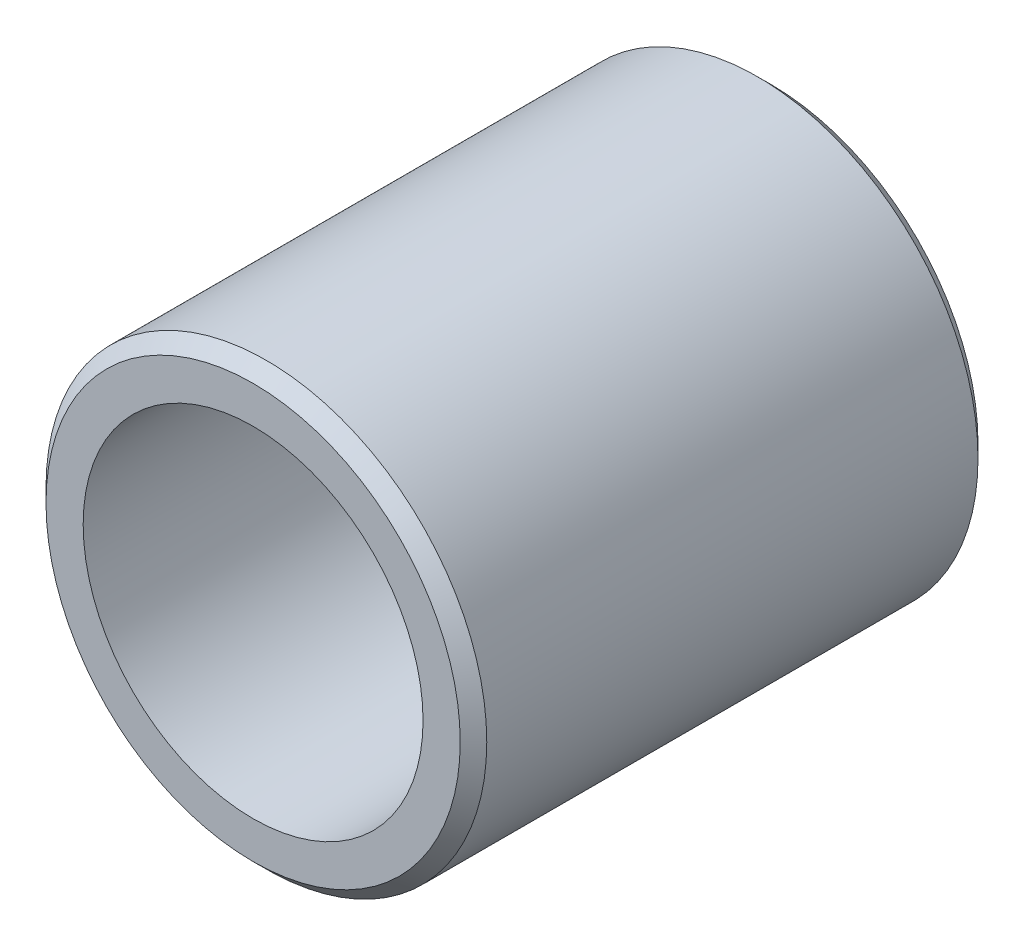
ISO-10303-21;
HEADER;
FILE_DESCRIPTION(('STEP AP214'),'2;1');
FILE_NAME('part.step','',(''),(''),'','','');
FILE_SCHEMA(('AUTOMOTIVE_DESIGN { 1 0 10303 214 1 1 1 1 }'));
ENDSEC;
DATA;
#1=APPLICATION_CONTEXT('core data for automotive mechanical design processes');
#2=APPLICATION_PROTOCOL_DEFINITION('international standard','automotive_design',2000,#1);
#3=PRODUCT_CONTEXT('',#1,'mechanical');
#4=PRODUCT('Part','Part','',(#3));
#5=PRODUCT_RELATED_PRODUCT_CATEGORY('part','',(#4));
#6=PRODUCT_DEFINITION_FORMATION('','',#4);
#7=PRODUCT_DEFINITION_CONTEXT('part definition',#1,'design');
#8=PRODUCT_DEFINITION('design','',#6,#7);
#9=PRODUCT_DEFINITION_SHAPE('','',#8);
#10=(LENGTH_UNIT() NAMED_UNIT(*) SI_UNIT(.MILLI.,.METRE.));
#11=(NAMED_UNIT(*) PLANE_ANGLE_UNIT() SI_UNIT($,.RADIAN.));
#12=(NAMED_UNIT(*) SI_UNIT($,.STERADIAN.) SOLID_ANGLE_UNIT());
#13=UNCERTAINTY_MEASURE_WITH_UNIT(LENGTH_MEASURE(1.E-05),#10,'distance_accuracy_value','');
#14=(GEOMETRIC_REPRESENTATION_CONTEXT(3) GLOBAL_UNCERTAINTY_ASSIGNED_CONTEXT((#13)) GLOBAL_UNIT_ASSIGNED_CONTEXT((#10,
#11,#12)) REPRESENTATION_CONTEXT('',''));
#15=CARTESIAN_POINT('',(0.,0.,0.));
#16=DIRECTION('',(0.,0.,1.));
#17=DIRECTION('',(1.,0.,0.));
#18=AXIS2_PLACEMENT_3D('',#15,#16,#17);
#19=CARTESIAN_POINT('',(0.,0.,19.5));
#20=DIRECTION('',(0.,0.,1.));
#21=DIRECTION('',(1.,0.,0.));
#22=AXIS2_PLACEMENT_3D('',#19,#20,#21);
#23=PLANE('',#22);
#24=CARTESIAN_POINT('',(0.,0.,19.5));
#25=DIRECTION('',(0.,0.,1.));
#26=DIRECTION('',(1.,0.,0.));
#27=AXIS2_PLACEMENT_3D('',#24,#25,#26);
#28=CIRCLE('',#27,7.79999999999999);
#29=CARTESIAN_POINT('',(7.79999999999999,0.,19.5));
#30=VERTEX_POINT('',#29);
#31=EDGE_CURVE('E12',#30,#30,#28,.T.);
#32=ORIENTED_EDGE('',*,*,#31,.T.);
#33=EDGE_LOOP('',(#32));
#34=FACE_BOUND('',#33,.T.);
#35=CARTESIAN_POINT('',(0.,0.,19.5));
#36=DIRECTION('',(0.,0.,1.));
#37=DIRECTION('',(1.,0.,0.));
#38=AXIS2_PLACEMENT_3D('',#35,#36,#37);
#39=CIRCLE('',#38,6.4);
#40=CARTESIAN_POINT('',(6.4,0.,19.5));
#41=VERTEX_POINT('',#40);
#42=EDGE_CURVE('E57',#41,#41,#39,.T.);
#43=ORIENTED_EDGE('',*,*,#42,.F.);
#44=EDGE_LOOP('',(#43));
#45=FACE_BOUND('',#44,.T.);
#46=ADVANCED_FACE('F37',(#34,#45),#23,.T.);
#47=CARTESIAN_POINT('',(0.,0.,0.));
#48=DIRECTION('',(0.,0.,1.));
#49=DIRECTION('',(1.,0.,0.));
#50=AXIS2_PLACEMENT_3D('',#47,#48,#49);
#51=PLANE('',#50);
#52=CARTESIAN_POINT('',(0.,0.,0.));
#53=DIRECTION('',(0.,0.,1.));
#54=DIRECTION('',(1.,0.,0.));
#55=AXIS2_PLACEMENT_3D('',#52,#53,#54);
#56=CIRCLE('',#55,7.79999999999999);
#57=CARTESIAN_POINT('',(7.79999999999999,0.,0.));
#58=VERTEX_POINT('',#57);
#59=EDGE_CURVE('E44',#58,#58,#56,.F.);
#60=ORIENTED_EDGE('',*,*,#59,.T.);
#61=EDGE_LOOP('',(#60));
#62=FACE_BOUND('',#61,.T.);
#63=CARTESIAN_POINT('',(0.,0.,0.));
#64=DIRECTION('',(0.,0.,1.));
#65=DIRECTION('',(1.,0.,0.));
#66=AXIS2_PLACEMENT_3D('',#63,#64,#65);
#67=CIRCLE('',#66,6.4);
#68=CARTESIAN_POINT('',(6.4,0.,0.));
#69=VERTEX_POINT('',#68);
#70=EDGE_CURVE('E60',#69,#69,#67,.T.);
#71=ORIENTED_EDGE('',*,*,#70,.T.);
#72=EDGE_LOOP('',(#71));
#73=FACE_BOUND('',#72,.T.);
#74=ADVANCED_FACE('F64',(#62,#73),#51,.F.);
#75=CARTESIAN_POINT('',(0.,0.,19.5));
#76=DIRECTION('',(0.,0.,-1.));
#77=DIRECTION('',(-1.,0.,0.));
#78=AXIS2_PLACEMENT_3D('',#75,#76,#77);
#79=CYLINDRICAL_SURFACE('',#78,8.3);
#80=CARTESIAN_POINT('',(0.,0.,0.500000000000004));
#81=DIRECTION('',(0.,0.,1.));
#82=DIRECTION('',(1.,0.,0.));
#83=AXIS2_PLACEMENT_3D('',#80,#81,#82);
#84=CIRCLE('',#83,8.3);
#85=CARTESIAN_POINT('',(8.3,0.,0.500000000000005));
#86=VERTEX_POINT('',#85);
#87=EDGE_CURVE('E48',#86,#86,#84,.T.);
#88=ORIENTED_EDGE('',*,*,#87,.T.);
#89=EDGE_LOOP('',(#88));
#90=FACE_BOUND('',#89,.T.);
#91=CARTESIAN_POINT('',(0.,0.,19.));
#92=DIRECTION('',(0.,0.,1.));
#93=DIRECTION('',(1.,0.,0.));
#94=AXIS2_PLACEMENT_3D('',#91,#92,#93);
#95=CIRCLE('',#94,8.3);
#96=CARTESIAN_POINT('',(8.3,0.,19.));
#97=VERTEX_POINT('',#96);
#98=EDGE_CURVE('E52',#97,#97,#95,.F.);
#99=ORIENTED_EDGE('',*,*,#98,.T.);
#100=EDGE_LOOP('',(#99));
#101=FACE_BOUND('',#100,.T.);
#102=ADVANCED_FACE('F39',(#90,#101),#79,.T.);
#103=CARTESIAN_POINT('',(0.,0.,19.5));
#104=DIRECTION('',(0.,0.,-1.));
#105=DIRECTION('',(-1.,0.,0.));
#106=AXIS2_PLACEMENT_3D('',#103,#104,#105);
#107=CYLINDRICAL_SURFACE('',#106,6.4);
#108=ORIENTED_EDGE('',*,*,#42,.T.);
#109=EDGE_LOOP('',(#108));
#110=FACE_BOUND('',#109,.T.);
#111=ORIENTED_EDGE('',*,*,#70,.F.);
#112=EDGE_LOOP('',(#111));
#113=FACE_BOUND('',#112,.T.);
#114=ADVANCED_FACE('F66',(#110,#113),#107,.F.);
#115=CARTESIAN_POINT('',(0.,0.,0.500000000000004));
#116=DIRECTION('',(0.,0.,1.));
#117=DIRECTION('',(1.,0.,0.));
#118=AXIS2_PLACEMENT_3D('',#115,#116,#117);
#119=CONICAL_SURFACE('',#118,8.3,0.785398163397453);
#120=ORIENTED_EDGE('',*,*,#59,.F.);
#121=EDGE_LOOP('',(#120));
#122=FACE_BOUND('',#121,.T.);
#123=ORIENTED_EDGE('',*,*,#87,.F.);
#124=EDGE_LOOP('',(#123));
#125=FACE_BOUND('',#124,.T.);
#126=ADVANCED_FACE('F68',(#122,#125),#119,.T.);
#127=CARTESIAN_POINT('',(0.,0.,19.5));
#128=DIRECTION('',(0.,0.,-1.));
#129=DIRECTION('',(-1.,0.,0.));
#130=AXIS2_PLACEMENT_3D('',#127,#128,#129);
#131=CONICAL_SURFACE('',#130,7.79999999999999,0.785398163397453);
#132=ORIENTED_EDGE('',*,*,#98,.F.);
#133=EDGE_LOOP('',(#132));
#134=FACE_BOUND('',#133,.T.);
#135=ORIENTED_EDGE('',*,*,#31,.F.);
#136=EDGE_LOOP('',(#135));
#137=FACE_BOUND('',#136,.T.);
#138=ADVANCED_FACE('F75',(#134,#137),#131,.T.);
#139=CLOSED_SHELL('',(#46,#74,#102,#114,#126,#138));
#140=MANIFOLD_SOLID_BREP('B2',#139);
#141=ADVANCED_BREP_SHAPE_REPRESENTATION('',(#18,#140),#14);
#142=SHAPE_DEFINITION_REPRESENTATION(#9,#141);
ENDSEC;
END-ISO-10303-21;
